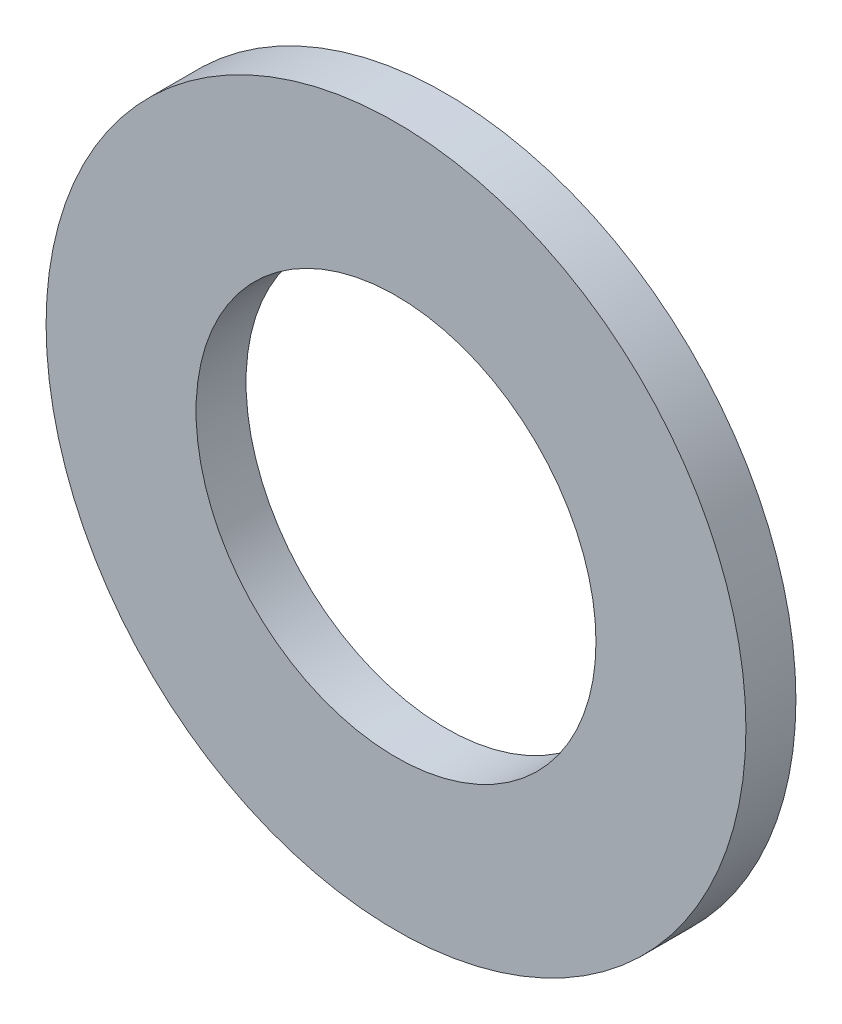
ISO-10303-21;
HEADER;
FILE_DESCRIPTION(('STEP AP214'),'2;1');
FILE_NAME('part.step','',(''),(''),'','','');
FILE_SCHEMA(('AUTOMOTIVE_DESIGN { 1 0 10303 214 1 1 1 1 }'));
ENDSEC;
DATA;
#1=APPLICATION_CONTEXT('core data for automotive mechanical design processes');
#2=APPLICATION_PROTOCOL_DEFINITION('international standard','automotive_design',2000,#1);
#3=PRODUCT_CONTEXT('',#1,'mechanical');
#4=PRODUCT('Part','Part','',(#3));
#5=PRODUCT_RELATED_PRODUCT_CATEGORY('part','',(#4));
#6=PRODUCT_DEFINITION_FORMATION('','',#4);
#7=PRODUCT_DEFINITION_CONTEXT('part definition',#1,'design');
#8=PRODUCT_DEFINITION('design','',#6,#7);
#9=PRODUCT_DEFINITION_SHAPE('','',#8);
#10=(LENGTH_UNIT() NAMED_UNIT(*) SI_UNIT(.MILLI.,.METRE.));
#11=(NAMED_UNIT(*) PLANE_ANGLE_UNIT() SI_UNIT($,.RADIAN.));
#12=(NAMED_UNIT(*) SI_UNIT($,.STERADIAN.) SOLID_ANGLE_UNIT());
#13=UNCERTAINTY_MEASURE_WITH_UNIT(LENGTH_MEASURE(1.E-05),#10,'distance_accuracy_value','');
#14=(GEOMETRIC_REPRESENTATION_CONTEXT(3) GLOBAL_UNCERTAINTY_ASSIGNED_CONTEXT((#13)) GLOBAL_UNIT_ASSIGNED_CONTEXT((#10,
#11,#12)) REPRESENTATION_CONTEXT('',''));
#15=CARTESIAN_POINT('',(0.,0.,0.));
#16=DIRECTION('',(0.,0.,1.));
#17=DIRECTION('',(1.,0.,0.));
#18=AXIS2_PLACEMENT_3D('',#15,#16,#17);
#19=CARTESIAN_POINT('',(0.,0.,0.5));
#20=DIRECTION('',(0.,0.,1.));
#21=DIRECTION('',(1.,0.,0.));
#22=AXIS2_PLACEMENT_3D('',#19,#20,#21);
#23=PLANE('',#22);
#24=CARTESIAN_POINT('',(0.,0.,0.5));
#25=DIRECTION('',(0.,0.,1.));
#26=DIRECTION('',(1.,0.,0.));
#27=AXIS2_PLACEMENT_3D('',#24,#25,#26);
#28=CIRCLE('',#27,3.5);
#29=CARTESIAN_POINT('',(3.5,0.,0.5));
#30=VERTEX_POINT('',#29);
#31=EDGE_CURVE('E10',#30,#30,#28,.T.);
#32=ORIENTED_EDGE('',*,*,#31,.T.);
#33=EDGE_LOOP('',(#32));
#34=FACE_BOUND('',#33,.T.);
#35=CARTESIAN_POINT('',(0.,0.,0.5));
#36=DIRECTION('',(0.,0.,1.));
#37=DIRECTION('',(1.,0.,0.));
#38=AXIS2_PLACEMENT_3D('',#35,#36,#37);
#39=CIRCLE('',#38,2.);
#40=CARTESIAN_POINT('',(2.,0.,0.5));
#41=VERTEX_POINT('',#40);
#42=EDGE_CURVE('E42',#41,#41,#39,.T.);
#43=ORIENTED_EDGE('',*,*,#42,.F.);
#44=EDGE_LOOP('',(#43));
#45=FACE_BOUND('',#44,.T.);
#46=ADVANCED_FACE('F31',(#34,#45),#23,.T.);
#47=CARTESIAN_POINT('',(0.,0.,0.));
#48=DIRECTION('',(0.,0.,1.));
#49=DIRECTION('',(1.,0.,0.));
#50=AXIS2_PLACEMENT_3D('',#47,#48,#49);
#51=PLANE('',#50);
#52=CARTESIAN_POINT('',(0.,0.,0.));
#53=DIRECTION('',(0.,0.,1.));
#54=DIRECTION('',(1.,0.,0.));
#55=AXIS2_PLACEMENT_3D('',#52,#53,#54);
#56=CIRCLE('',#55,3.5);
#57=CARTESIAN_POINT('',(3.5,0.,0.));
#58=VERTEX_POINT('',#57);
#59=EDGE_CURVE('E35',#58,#58,#56,.T.);
#60=ORIENTED_EDGE('',*,*,#59,.F.);
#61=EDGE_LOOP('',(#60));
#62=FACE_BOUND('',#61,.T.);
#63=CARTESIAN_POINT('',(0.,0.,0.));
#64=DIRECTION('',(0.,0.,1.));
#65=DIRECTION('',(1.,0.,0.));
#66=AXIS2_PLACEMENT_3D('',#63,#64,#65);
#67=CIRCLE('',#66,2.);
#68=CARTESIAN_POINT('',(2.,0.,0.));
#69=VERTEX_POINT('',#68);
#70=EDGE_CURVE('E44',#69,#69,#67,.T.);
#71=ORIENTED_EDGE('',*,*,#70,.T.);
#72=EDGE_LOOP('',(#71));
#73=FACE_BOUND('',#72,.T.);
#74=ADVANCED_FACE('F54',(#62,#73),#51,.F.);
#75=CARTESIAN_POINT('',(0.,0.,0.5));
#76=DIRECTION('',(0.,0.,-1.));
#77=DIRECTION('',(-1.,0.,0.));
#78=AXIS2_PLACEMENT_3D('',#75,#76,#77);
#79=CYLINDRICAL_SURFACE('',#78,3.5);
#80=ORIENTED_EDGE('',*,*,#31,.F.);
#81=EDGE_LOOP('',(#80));
#82=FACE_BOUND('',#81,.T.);
#83=ORIENTED_EDGE('',*,*,#59,.T.);
#84=EDGE_LOOP('',(#83));
#85=FACE_BOUND('',#84,.T.);
#86=ADVANCED_FACE('F33',(#82,#85),#79,.T.);
#87=CARTESIAN_POINT('',(0.,0.,0.5));
#88=DIRECTION('',(0.,0.,-1.));
#89=DIRECTION('',(-1.,0.,0.));
#90=AXIS2_PLACEMENT_3D('',#87,#88,#89);
#91=CYLINDRICAL_SURFACE('',#90,2.);
#92=ORIENTED_EDGE('',*,*,#42,.T.);
#93=EDGE_LOOP('',(#92));
#94=FACE_BOUND('',#93,.T.);
#95=ORIENTED_EDGE('',*,*,#70,.F.);
#96=EDGE_LOOP('',(#95));
#97=FACE_BOUND('',#96,.T.);
#98=ADVANCED_FACE('F50',(#94,#97),#91,.F.);
#99=CLOSED_SHELL('',(#46,#74,#86,#98));
#100=MANIFOLD_SOLID_BREP('B2',#99);
#101=ADVANCED_BREP_SHAPE_REPRESENTATION('',(#18,#100),#14);
#102=SHAPE_DEFINITION_REPRESENTATION(#9,#101);
ENDSEC;
END-ISO-10303-21;
